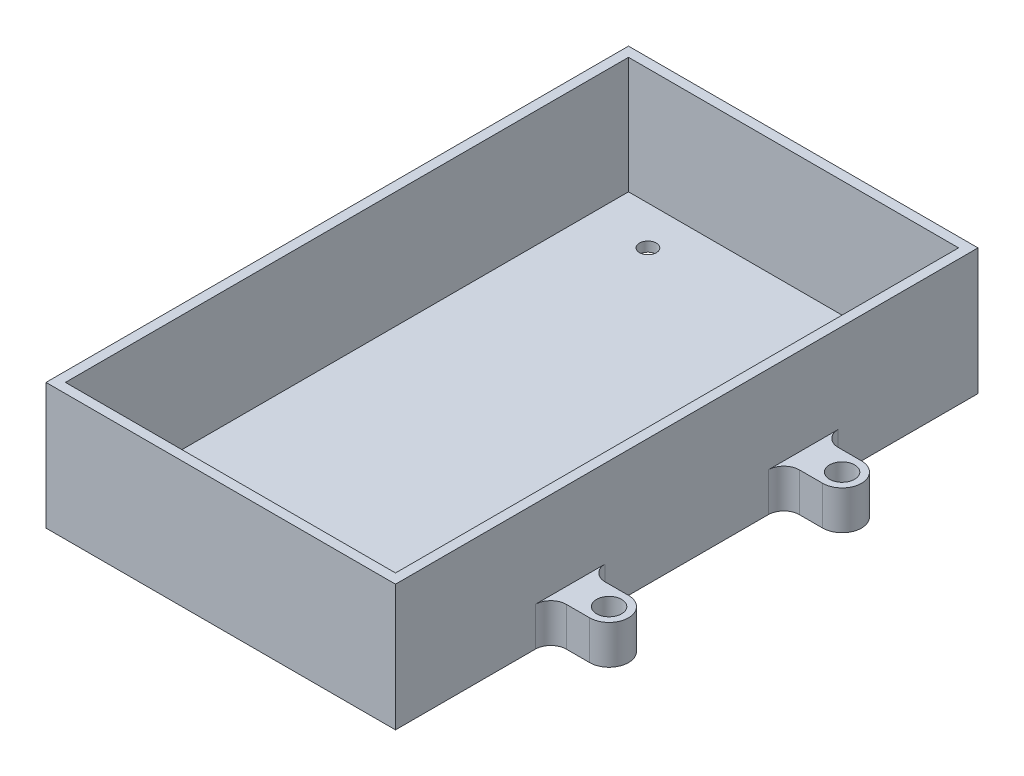
ISO-10303-21;
HEADER;
FILE_DESCRIPTION(('STEP AP214'),'2;1');
FILE_NAME('part.step','',(''),(''),'','','');
FILE_SCHEMA(('AUTOMOTIVE_DESIGN { 1 0 10303 214 1 1 1 1 }'));
ENDSEC;
DATA;
#1=APPLICATION_CONTEXT('core data for automotive mechanical design processes');
#2=APPLICATION_PROTOCOL_DEFINITION('international standard','automotive_design',2000,#1);
#3=PRODUCT_CONTEXT('',#1,'mechanical');
#4=PRODUCT('Part','Part','',(#3));
#5=PRODUCT_RELATED_PRODUCT_CATEGORY('part','',(#4));
#6=PRODUCT_DEFINITION_FORMATION('','',#4);
#7=PRODUCT_DEFINITION_CONTEXT('part definition',#1,'design');
#8=PRODUCT_DEFINITION('design','',#6,#7);
#9=PRODUCT_DEFINITION_SHAPE('','',#8);
#10=(LENGTH_UNIT() NAMED_UNIT(*) SI_UNIT(.MILLI.,.METRE.));
#11=(NAMED_UNIT(*) PLANE_ANGLE_UNIT() SI_UNIT($,.RADIAN.));
#12=(NAMED_UNIT(*) SI_UNIT($,.STERADIAN.) SOLID_ANGLE_UNIT());
#13=UNCERTAINTY_MEASURE_WITH_UNIT(LENGTH_MEASURE(1.E-05),#10,'distance_accuracy_value','');
#14=(GEOMETRIC_REPRESENTATION_CONTEXT(3) GLOBAL_UNCERTAINTY_ASSIGNED_CONTEXT((#13)) GLOBAL_UNIT_ASSIGNED_CONTEXT((#10,
#11,#12)) REPRESENTATION_CONTEXT('',''));
#15=CARTESIAN_POINT('',(0.,0.,0.));
#16=DIRECTION('',(0.,0.,1.));
#17=DIRECTION('',(1.,0.,0.));
#18=AXIS2_PLACEMENT_3D('',#15,#16,#17);
#19=CARTESIAN_POINT('',(28.575,-1.5875,0.));
#20=DIRECTION('',(-1.,0.,0.));
#21=DIRECTION('',(0.,0.,1.));
#22=AXIS2_PLACEMENT_3D('',#19,#20,#21);
#23=PLANE('',#22);
#24=DIRECTION('',(0.,0.,1.));
#25=VECTOR('',#24,1.);
#26=CARTESIAN_POINT('',(28.575,4.7625,0.));
#27=LINE('',#26,#25);
#28=CARTESIAN_POINT('',(28.575,4.7625,-24.765));
#29=VERTEX_POINT('',#28);
#30=CARTESIAN_POINT('',(28.575,4.7625,-13.335));
#31=VERTEX_POINT('',#30);
#32=EDGE_CURVE('E265',#29,#31,#27,.T.);
#33=ORIENTED_EDGE('',*,*,#32,.F.);
#34=DIRECTION('',(0.,-1.,0.));
#35=VECTOR('',#34,1.);
#36=CARTESIAN_POINT('',(28.575,-1.5875,-24.765));
#37=LINE('',#36,#35);
#38=CARTESIAN_POINT('',(28.575,-1.5875,-24.765));
#39=VERTEX_POINT('',#38);
#40=EDGE_CURVE('E383',#29,#39,#37,.T.);
#41=ORIENTED_EDGE('',*,*,#40,.T.);
#42=DIRECTION('',(0.,0.,1.));
#43=VECTOR('',#42,1.);
#44=CARTESIAN_POINT('',(28.575,-1.5875,0.));
#45=LINE('',#44,#43);
#46=CARTESIAN_POINT('',(28.575,-1.5875,-47.625));
#47=VERTEX_POINT('',#46);
#48=EDGE_CURVE('E352',#47,#39,#45,.T.);
#49=ORIENTED_EDGE('',*,*,#48,.F.);
#50=DIRECTION('',(0.,1.,0.));
#51=VECTOR('',#50,1.);
#52=CARTESIAN_POINT('',(28.575,-1.5875,-47.625));
#53=LINE('',#52,#51);
#54=CARTESIAN_POINT('',(28.575,19.05,-47.625));
#55=VERTEX_POINT('',#54);
#56=EDGE_CURVE('E367',#47,#55,#53,.T.);
#57=ORIENTED_EDGE('',*,*,#56,.T.);
#58=DIRECTION('',(0.,0.,1.));
#59=VECTOR('',#58,1.);
#60=CARTESIAN_POINT('',(28.575,19.05,0.));
#61=LINE('',#60,#59);
#62=CARTESIAN_POINT('',(28.575,19.05,47.625));
#63=VERTEX_POINT('',#62);
#64=EDGE_CURVE('E306',#55,#63,#61,.T.);
#65=ORIENTED_EDGE('',*,*,#64,.T.);
#66=DIRECTION('',(0.,1.,0.));
#67=VECTOR('',#66,1.);
#68=CARTESIAN_POINT('',(28.575,-1.5875,47.625));
#69=LINE('',#68,#67);
#70=CARTESIAN_POINT('',(28.575,-1.5875,47.625));
#71=VERTEX_POINT('',#70);
#72=EDGE_CURVE('E370',#71,#63,#69,.T.);
#73=ORIENTED_EDGE('',*,*,#72,.F.);
#74=CARTESIAN_POINT('',(28.575,-1.5875,24.765));
#75=VERTEX_POINT('',#74);
#76=EDGE_CURVE('E351',#75,#71,#45,.T.);
#77=ORIENTED_EDGE('',*,*,#76,.F.);
#78=DIRECTION('',(0.,-1.,0.));
#79=VECTOR('',#78,1.);
#80=CARTESIAN_POINT('',(28.575,-1.5875,24.765));
#81=LINE('',#80,#79);
#82=CARTESIAN_POINT('',(28.575,4.7625,24.765));
#83=VERTEX_POINT('',#82);
#84=EDGE_CURVE('E369',#75,#83,#81,.F.);
#85=ORIENTED_EDGE('',*,*,#84,.T.);
#86=DIRECTION('',(0.,0.,1.));
#87=VECTOR('',#86,1.);
#88=CARTESIAN_POINT('',(28.575,4.7625,0.));
#89=LINE('',#88,#87);
#90=CARTESIAN_POINT('',(28.575,4.7625,13.335));
#91=VERTEX_POINT('',#90);
#92=EDGE_CURVE('E254',#91,#83,#89,.T.);
#93=ORIENTED_EDGE('',*,*,#92,.F.);
#94=DIRECTION('',(0.,-1.,0.));
#95=VECTOR('',#94,1.);
#96=CARTESIAN_POINT('',(28.575,-1.5875,13.335));
#97=LINE('',#96,#95);
#98=CARTESIAN_POINT('',(28.575,-1.5875,13.335));
#99=VERTEX_POINT('',#98);
#100=EDGE_CURVE('E377',#91,#99,#97,.T.);
#101=ORIENTED_EDGE('',*,*,#100,.T.);
#102=CARTESIAN_POINT('',(28.575,-1.5875,-13.335));
#103=VERTEX_POINT('',#102);
#104=EDGE_CURVE('E356',#103,#99,#45,.T.);
#105=ORIENTED_EDGE('',*,*,#104,.F.);
#106=DIRECTION('',(0.,-1.,0.));
#107=VECTOR('',#106,1.);
#108=CARTESIAN_POINT('',(28.575,4.7625,-13.335));
#109=LINE('',#108,#107);
#110=EDGE_CURVE('E380',#103,#31,#109,.F.);
#111=ORIENTED_EDGE('',*,*,#110,.T.);
#112=EDGE_LOOP('',(#33,#41,#49,#57,#65,#73,#77,#85,#93,#101,#105,#111));
#113=FACE_BOUND('',#112,.T.);
#114=ADVANCED_FACE('F77',(#113),#23,.F.);
#115=CARTESIAN_POINT('',(0.,0.,0.));
#116=DIRECTION('',(0.,1.,0.));
#117=DIRECTION('',(0.,0.,1.));
#118=AXIS2_PLACEMENT_3D('',#115,#116,#117);
#119=PLANE('',#118);
#120=CARTESIAN_POINT('',(17.4624999999999,0.,39.6875));
#121=DIRECTION('',(0.,1.,0.));
#122=DIRECTION('',(0.,0.,1.));
#123=AXIS2_PLACEMENT_3D('',#120,#121,#122);
#124=CIRCLE('',#123,1.375);
#125=CARTESIAN_POINT('',(17.4624999999999,0.,41.0625));
#126=VERTEX_POINT('',#125);
#127=EDGE_CURVE('E334',#126,#126,#124,.F.);
#128=ORIENTED_EDGE('',*,*,#127,.T.);
#129=EDGE_LOOP('',(#128));
#130=FACE_BOUND('',#129,.T.);
#131=CARTESIAN_POINT('',(-17.4625,0.,-39.6875));
#132=DIRECTION('',(0.,1.,0.));
#133=DIRECTION('',(0.,0.,1.));
#134=AXIS2_PLACEMENT_3D('',#131,#132,#133);
#135=CIRCLE('',#134,1.375);
#136=CARTESIAN_POINT('',(-17.4625,0.,-38.3125));
#137=VERTEX_POINT('',#136);
#138=EDGE_CURVE('E362',#137,#137,#135,.T.);
#139=ORIENTED_EDGE('',*,*,#138,.F.);
#140=EDGE_LOOP('',(#139));
#141=FACE_BOUND('',#140,.T.);
#142=CARTESIAN_POINT('',(17.4625,0.,-39.6875));
#143=DIRECTION('',(0.,1.,0.));
#144=DIRECTION('',(0.,0.,1.));
#145=AXIS2_PLACEMENT_3D('',#142,#143,#144);
#146=CIRCLE('',#145,1.375);
#147=CARTESIAN_POINT('',(17.4625,0.,-38.3125));
#148=VERTEX_POINT('',#147);
#149=EDGE_CURVE('E359',#148,#148,#146,.T.);
#150=ORIENTED_EDGE('',*,*,#149,.F.);
#151=EDGE_LOOP('',(#150));
#152=FACE_BOUND('',#151,.T.);
#153=CARTESIAN_POINT('',(-17.4625000000001,0.,39.6875));
#154=DIRECTION('',(0.,1.,0.));
#155=DIRECTION('',(0.,0.,1.));
#156=AXIS2_PLACEMENT_3D('',#153,#154,#155);
#157=CIRCLE('',#156,1.375);
#158=CARTESIAN_POINT('',(-17.4625000000001,0.,41.0625));
#159=VERTEX_POINT('',#158);
#160=EDGE_CURVE('E329',#159,#159,#157,.F.);
#161=ORIENTED_EDGE('',*,*,#160,.T.);
#162=EDGE_LOOP('',(#161));
#163=FACE_BOUND('',#162,.T.);
#164=DIRECTION('',(0.,0.,-1.));
#165=VECTOR('',#164,1.);
#166=CARTESIAN_POINT('',(-26.9875,0.,0.));
#167=LINE('',#166,#165);
#168=CARTESIAN_POINT('',(-26.9875,0.,46.0375));
#169=VERTEX_POINT('',#168);
#170=CARTESIAN_POINT('',(-26.9875,0.,-46.0375));
#171=VERTEX_POINT('',#170);
#172=EDGE_CURVE('E312',#169,#171,#167,.T.);
#173=ORIENTED_EDGE('',*,*,#172,.F.);
#174=DIRECTION('',(-1.,0.,0.));
#175=VECTOR('',#174,1.);
#176=CARTESIAN_POINT('',(0.,0.,46.0375));
#177=LINE('',#176,#175);
#178=CARTESIAN_POINT('',(26.9875,0.,46.0375));
#179=VERTEX_POINT('',#178);
#180=EDGE_CURVE('E282',#179,#169,#177,.T.);
#181=ORIENTED_EDGE('',*,*,#180,.F.);
#182=DIRECTION('',(0.,0.,-1.));
#183=VECTOR('',#182,1.);
#184=CARTESIAN_POINT('',(26.9875,0.,0.));
#185=LINE('',#184,#183);
#186=CARTESIAN_POINT('',(26.9875,0.,-46.0375));
#187=VERTEX_POINT('',#186);
#188=EDGE_CURVE('E289',#179,#187,#185,.T.);
#189=ORIENTED_EDGE('',*,*,#188,.T.);
#190=DIRECTION('',(-1.,0.,0.));
#191=VECTOR('',#190,1.);
#192=CARTESIAN_POINT('',(0.,0.,-46.0375));
#193=LINE('',#192,#191);
#194=EDGE_CURVE('E315',#187,#171,#193,.T.);
#195=ORIENTED_EDGE('',*,*,#194,.T.);
#196=EDGE_LOOP('',(#173,#181,#189,#195));
#197=FACE_BOUND('',#196,.T.);
#198=ADVANCED_FACE('F473',(#130,#141,#152,#163,#197),#119,.T.);
#199=CARTESIAN_POINT('',(0.,-1.5875,-47.625));
#200=DIRECTION('',(0.,0.,-1.));
#201=DIRECTION('',(-1.,0.,0.));
#202=AXIS2_PLACEMENT_3D('',#199,#200,#201);
#203=PLANE('',#202);
#204=DIRECTION('',(0.,1.,0.));
#205=VECTOR('',#204,1.);
#206=CARTESIAN_POINT('',(-28.575,-1.5875,-47.625));
#207=LINE('',#206,#205);
#208=CARTESIAN_POINT('',(-28.575,-1.5875,-47.625));
#209=VERTEX_POINT('',#208);
#210=CARTESIAN_POINT('',(-28.575,19.05,-47.625));
#211=VERTEX_POINT('',#210);
#212=EDGE_CURVE('E355',#209,#211,#207,.T.);
#213=ORIENTED_EDGE('',*,*,#212,.T.);
#214=DIRECTION('',(-1.,0.,0.));
#215=VECTOR('',#214,1.);
#216=CARTESIAN_POINT('',(0.,19.05,-47.625));
#217=LINE('',#216,#215);
#218=EDGE_CURVE('E297',#55,#211,#217,.T.);
#219=ORIENTED_EDGE('',*,*,#218,.F.);
#220=ORIENTED_EDGE('',*,*,#56,.F.);
#221=DIRECTION('',(-1.,0.,0.));
#222=VECTOR('',#221,1.);
#223=CARTESIAN_POINT('',(0.,-1.5875,-47.625));
#224=LINE('',#223,#222);
#225=EDGE_CURVE('E343',#47,#209,#224,.T.);
#226=ORIENTED_EDGE('',*,*,#225,.T.);
#227=EDGE_LOOP('',(#213,#219,#220,#226));
#228=FACE_BOUND('',#227,.T.);
#229=ADVANCED_FACE('F443',(#228),#203,.T.);
#230=CARTESIAN_POINT('',(0.,-1.5875,47.625));
#231=DIRECTION('',(0.,0.,-1.));
#232=DIRECTION('',(-1.,0.,0.));
#233=AXIS2_PLACEMENT_3D('',#230,#231,#232);
#234=PLANE('',#233);
#235=ORIENTED_EDGE('',*,*,#72,.T.);
#236=DIRECTION('',(-1.,0.,0.));
#237=VECTOR('',#236,1.);
#238=CARTESIAN_POINT('',(0.,19.05,47.625));
#239=LINE('',#238,#237);
#240=CARTESIAN_POINT('',(-28.575,19.05,47.625));
#241=VERTEX_POINT('',#240);
#242=EDGE_CURVE('E303',#63,#241,#239,.T.);
#243=ORIENTED_EDGE('',*,*,#242,.T.);
#244=DIRECTION('',(0.,1.,0.));
#245=VECTOR('',#244,1.);
#246=CARTESIAN_POINT('',(-28.575,-1.5875,47.625));
#247=LINE('',#246,#245);
#248=CARTESIAN_POINT('',(-28.575,-1.5875,47.625));
#249=VERTEX_POINT('',#248);
#250=EDGE_CURVE('E372',#249,#241,#247,.T.);
#251=ORIENTED_EDGE('',*,*,#250,.F.);
#252=DIRECTION('',(-1.,0.,0.));
#253=VECTOR('',#252,1.);
#254=CARTESIAN_POINT('',(0.,-1.5875,47.625));
#255=LINE('',#254,#253);
#256=EDGE_CURVE('E349',#71,#249,#255,.T.);
#257=ORIENTED_EDGE('',*,*,#256,.F.);
#258=EDGE_LOOP('',(#235,#243,#251,#257));
#259=FACE_BOUND('',#258,.T.);
#260=ADVANCED_FACE('F452',(#259),#234,.F.);
#261=CARTESIAN_POINT('',(17.4624999999999,-1.5875,39.6875));
#262=DIRECTION('',(0.,1.,0.));
#263=DIRECTION('',(0.,0.,1.));
#264=AXIS2_PLACEMENT_3D('',#261,#262,#263);
#265=CYLINDRICAL_SURFACE('',#264,1.375);
#266=CARTESIAN_POINT('',(17.4624999999999,-1.5875,39.6875));
#267=DIRECTION('',(0.,1.,0.));
#268=DIRECTION('',(0.,0.,1.));
#269=AXIS2_PLACEMENT_3D('',#266,#267,#268);
#270=CIRCLE('',#269,1.375);
#271=CARTESIAN_POINT('',(17.4624999999999,-1.5875,41.0625));
#272=VERTEX_POINT('',#271);
#273=EDGE_CURVE('E340',#272,#272,#270,.F.);
#274=ORIENTED_EDGE('',*,*,#273,.T.);
#275=EDGE_LOOP('',(#274));
#276=FACE_BOUND('',#275,.T.);
#277=ORIENTED_EDGE('',*,*,#127,.F.);
#278=EDGE_LOOP('',(#277));
#279=FACE_BOUND('',#278,.T.);
#280=ADVANCED_FACE('F481',(#276,#279),#265,.F.);
#281=CARTESIAN_POINT('',(-17.4625,-1.5875,-39.6875));
#282=DIRECTION('',(0.,1.,0.));
#283=DIRECTION('',(0.,0.,1.));
#284=AXIS2_PLACEMENT_3D('',#281,#282,#283);
#285=CYLINDRICAL_SURFACE('',#284,1.375);
#286=CARTESIAN_POINT('',(-17.4625,-1.5875,-39.6875));
#287=DIRECTION('',(0.,1.,0.));
#288=DIRECTION('',(0.,0.,1.));
#289=AXIS2_PLACEMENT_3D('',#286,#287,#288);
#290=CIRCLE('',#289,1.375);
#291=CARTESIAN_POINT('',(-17.4625,-1.5875,-38.3125));
#292=VERTEX_POINT('',#291);
#293=EDGE_CURVE('E337',#292,#292,#290,.T.);
#294=ORIENTED_EDGE('',*,*,#293,.F.);
#295=EDGE_LOOP('',(#294));
#296=FACE_BOUND('',#295,.T.);
#297=ORIENTED_EDGE('',*,*,#138,.T.);
#298=EDGE_LOOP('',(#297));
#299=FACE_BOUND('',#298,.T.);
#300=ADVANCED_FACE('F486',(#296,#299),#285,.F.);
#301=CARTESIAN_POINT('',(17.4625,-1.5875,-39.6875));
#302=DIRECTION('',(0.,1.,0.));
#303=DIRECTION('',(0.,0.,1.));
#304=AXIS2_PLACEMENT_3D('',#301,#302,#303);
#305=CYLINDRICAL_SURFACE('',#304,1.375);
#306=CARTESIAN_POINT('',(17.4625,-1.5875,-39.6875));
#307=DIRECTION('',(0.,1.,0.));
#308=DIRECTION('',(0.,0.,1.));
#309=AXIS2_PLACEMENT_3D('',#306,#307,#308);
#310=CIRCLE('',#309,1.375);
#311=CARTESIAN_POINT('',(17.4625,-1.5875,-38.3125));
#312=VERTEX_POINT('',#311);
#313=EDGE_CURVE('E333',#312,#312,#310,.T.);
#314=ORIENTED_EDGE('',*,*,#313,.F.);
#315=EDGE_LOOP('',(#314));
#316=FACE_BOUND('',#315,.T.);
#317=ORIENTED_EDGE('',*,*,#149,.T.);
#318=EDGE_LOOP('',(#317));
#319=FACE_BOUND('',#318,.T.);
#320=ADVANCED_FACE('F467',(#316,#319),#305,.F.);
#321=CARTESIAN_POINT('',(-17.4625000000001,-1.5875,39.6875));
#322=DIRECTION('',(0.,1.,0.));
#323=DIRECTION('',(0.,0.,1.));
#324=AXIS2_PLACEMENT_3D('',#321,#322,#323);
#325=CYLINDRICAL_SURFACE('',#324,1.375);
#326=CARTESIAN_POINT('',(-17.4625000000001,-1.5875,39.6875));
#327=DIRECTION('',(0.,1.,0.));
#328=DIRECTION('',(0.,0.,1.));
#329=AXIS2_PLACEMENT_3D('',#326,#327,#328);
#330=CIRCLE('',#329,1.375);
#331=CARTESIAN_POINT('',(-17.4625000000001,-1.5875,41.0625));
#332=VERTEX_POINT('',#331);
#333=EDGE_CURVE('E330',#332,#332,#330,.F.);
#334=ORIENTED_EDGE('',*,*,#333,.T.);
#335=EDGE_LOOP('',(#334));
#336=FACE_BOUND('',#335,.T.);
#337=ORIENTED_EDGE('',*,*,#160,.F.);
#338=EDGE_LOOP('',(#337));
#339=FACE_BOUND('',#338,.T.);
#340=ADVANCED_FACE('F456',(#336,#339),#325,.F.);
#341=CARTESIAN_POINT('',(-28.575,-1.5875,0.));
#342=DIRECTION('',(-1.,0.,0.));
#343=DIRECTION('',(0.,0.,1.));
#344=AXIS2_PLACEMENT_3D('',#341,#342,#343);
#345=PLANE('',#344);
#346=ORIENTED_EDGE('',*,*,#250,.T.);
#347=DIRECTION('',(0.,0.,1.));
#348=VECTOR('',#347,1.);
#349=CARTESIAN_POINT('',(-28.575,19.05,0.));
#350=LINE('',#349,#348);
#351=EDGE_CURVE('E300',#211,#241,#350,.T.);
#352=ORIENTED_EDGE('',*,*,#351,.F.);
#353=ORIENTED_EDGE('',*,*,#212,.F.);
#354=DIRECTION('',(0.,0.,1.));
#355=VECTOR('',#354,1.);
#356=CARTESIAN_POINT('',(-28.575,-1.5875,0.));
#357=LINE('',#356,#355);
#358=EDGE_CURVE('E346',#209,#249,#357,.T.);
#359=ORIENTED_EDGE('',*,*,#358,.T.);
#360=EDGE_LOOP('',(#346,#352,#353,#359));
#361=FACE_BOUND('',#360,.T.);
#362=ADVANCED_FACE('F454',(#361),#345,.T.);
#363=CARTESIAN_POINT('',(0.,-1.5875,0.));
#364=DIRECTION('',(0.,1.,0.));
#365=DIRECTION('',(0.,0.,1.));
#366=AXIS2_PLACEMENT_3D('',#363,#364,#365);
#367=PLANE('',#366);
#368=ORIENTED_EDGE('',*,*,#333,.F.);
#369=EDGE_LOOP('',(#368));
#370=FACE_BOUND('',#369,.T.);
#371=ORIENTED_EDGE('',*,*,#313,.T.);
#372=EDGE_LOOP('',(#371));
#373=FACE_BOUND('',#372,.T.);
#374=ORIENTED_EDGE('',*,*,#293,.T.);
#375=EDGE_LOOP('',(#374));
#376=FACE_BOUND('',#375,.T.);
#377=ORIENTED_EDGE('',*,*,#273,.F.);
#378=EDGE_LOOP('',(#377));
#379=FACE_BOUND('',#378,.T.);
#380=ORIENTED_EDGE('',*,*,#225,.F.);
#381=ORIENTED_EDGE('',*,*,#48,.T.);
#382=CARTESIAN_POINT('',(31.115,-1.5875,-24.765));
#383=DIRECTION('',(0.,1.,0.));
#384=DIRECTION('',(0.,0.,1.));
#385=AXIS2_PLACEMENT_3D('',#382,#383,#384);
#386=CIRCLE('',#385,2.54);
#387=CARTESIAN_POINT('',(31.115,-1.5875,-22.225));
#388=VERTEX_POINT('',#387);
#389=EDGE_CURVE('E395',#39,#388,#386,.T.);
#390=ORIENTED_EDGE('',*,*,#389,.T.);
#391=DIRECTION('',(-1.,0.,0.));
#392=VECTOR('',#391,1.);
#393=CARTESIAN_POINT('',(0.,-1.5875,-22.2249999999999));
#394=LINE('',#393,#392);
#395=CARTESIAN_POINT('',(34.925,-1.5875,-22.225));
#396=VERTEX_POINT('',#395);
#397=EDGE_CURVE('E249',#396,#388,#394,.T.);
#398=ORIENTED_EDGE('',*,*,#397,.F.);
#399=CARTESIAN_POINT('',(34.925,-1.5875,-19.05));
#400=DIRECTION('',(0.,-1.,0.));
#401=DIRECTION('',(0.,0.,-1.));
#402=AXIS2_PLACEMENT_3D('',#399,#400,#401);
#403=CIRCLE('',#402,3.175);
#404=CARTESIAN_POINT('',(34.925,-1.5875,-15.875));
#405=VERTEX_POINT('',#404);
#406=EDGE_CURVE('E273',#405,#396,#403,.F.);
#407=ORIENTED_EDGE('',*,*,#406,.F.);
#408=DIRECTION('',(1.,0.,0.));
#409=VECTOR('',#408,1.);
#410=CARTESIAN_POINT('',(0.,-1.5875,-15.875));
#411=LINE('',#410,#409);
#412=CARTESIAN_POINT('',(31.115,-1.5875,-15.875));
#413=VERTEX_POINT('',#412);
#414=EDGE_CURVE('E275',#413,#405,#411,.T.);
#415=ORIENTED_EDGE('',*,*,#414,.F.);
#416=CARTESIAN_POINT('',(31.115,-1.5875,-13.335));
#417=DIRECTION('',(0.,1.,0.));
#418=DIRECTION('',(0.,0.,1.));
#419=AXIS2_PLACEMENT_3D('',#416,#417,#418);
#420=CIRCLE('',#419,2.54);
#421=EDGE_CURVE('E400',#413,#103,#420,.T.);
#422=ORIENTED_EDGE('',*,*,#421,.T.);
#423=ORIENTED_EDGE('',*,*,#104,.T.);
#424=CARTESIAN_POINT('',(31.115,-1.5875,13.335));
#425=DIRECTION('',(0.,1.,0.));
#426=DIRECTION('',(0.,0.,1.));
#427=AXIS2_PLACEMENT_3D('',#424,#425,#426);
#428=CIRCLE('',#427,2.54);
#429=CARTESIAN_POINT('',(31.115,-1.5875,15.875));
#430=VERTEX_POINT('',#429);
#431=EDGE_CURVE('E223',#99,#430,#428,.T.);
#432=ORIENTED_EDGE('',*,*,#431,.T.);
#433=DIRECTION('',(1.,0.,0.));
#434=VECTOR('',#433,1.);
#435=CARTESIAN_POINT('',(0.,-1.5875,15.875));
#436=LINE('',#435,#434);
#437=CARTESIAN_POINT('',(34.925,-1.5875,15.875));
#438=VERTEX_POINT('',#437);
#439=EDGE_CURVE('E213',#430,#438,#436,.T.);
#440=ORIENTED_EDGE('',*,*,#439,.T.);
#441=CARTESIAN_POINT('',(34.925,-1.5875,19.05));
#442=DIRECTION('',(0.,-1.,0.));
#443=DIRECTION('',(0.,0.,-1.));
#444=AXIS2_PLACEMENT_3D('',#441,#442,#443);
#445=CIRCLE('',#444,3.175);
#446=CARTESIAN_POINT('',(34.925,-1.5875,22.225));
#447=VERTEX_POINT('',#446);
#448=EDGE_CURVE('E220',#438,#447,#445,.T.);
#449=ORIENTED_EDGE('',*,*,#448,.T.);
#450=DIRECTION('',(-1.,0.,0.));
#451=VECTOR('',#450,1.);
#452=CARTESIAN_POINT('',(0.,-1.5875,22.225));
#453=LINE('',#452,#451);
#454=CARTESIAN_POINT('',(31.115,-1.5875,22.225));
#455=VERTEX_POINT('',#454);
#456=EDGE_CURVE('E226',#447,#455,#453,.T.);
#457=ORIENTED_EDGE('',*,*,#456,.T.);
#458=CARTESIAN_POINT('',(31.115,-1.5875,24.765));
#459=DIRECTION('',(0.,1.,0.));
#460=DIRECTION('',(0.,0.,1.));
#461=AXIS2_PLACEMENT_3D('',#458,#459,#460);
#462=CIRCLE('',#461,2.54);
#463=EDGE_CURVE('E85',#455,#75,#462,.T.);
#464=ORIENTED_EDGE('',*,*,#463,.T.);
#465=ORIENTED_EDGE('',*,*,#76,.T.);
#466=ORIENTED_EDGE('',*,*,#256,.T.);
#467=ORIENTED_EDGE('',*,*,#358,.F.);
#468=EDGE_LOOP('',(#380,#381,#390,#398,#407,#415,#422,#423,#432,#440,#449,#457,#464,#465,#466,#467));
#469=FACE_BOUND('',#468,.T.);
#470=CARTESIAN_POINT('',(34.925,-1.5875,-19.05));
#471=DIRECTION('',(0.,-1.,0.));
#472=DIRECTION('',(0.,0.,-1.));
#473=AXIS2_PLACEMENT_3D('',#470,#471,#472);
#474=CIRCLE('',#473,2.05);
#475=CARTESIAN_POINT('',(34.925,-1.5875,-21.1));
#476=VERTEX_POINT('',#475);
#477=EDGE_CURVE('E261',#476,#476,#474,.F.);
#478=ORIENTED_EDGE('',*,*,#477,.T.);
#479=EDGE_LOOP('',(#478));
#480=FACE_BOUND('',#479,.T.);
#481=CARTESIAN_POINT('',(34.925,-1.5875,19.05));
#482=DIRECTION('',(0.,-1.,0.));
#483=DIRECTION('',(0.,0.,-1.));
#484=AXIS2_PLACEMENT_3D('',#481,#482,#483);
#485=CIRCLE('',#484,2.05);
#486=CARTESIAN_POINT('',(34.925,-1.5875,17.));
#487=VERTEX_POINT('',#486);
#488=EDGE_CURVE('E244',#487,#487,#485,.T.);
#489=ORIENTED_EDGE('',*,*,#488,.F.);
#490=EDGE_LOOP('',(#489));
#491=FACE_BOUND('',#490,.T.);
#492=ADVANCED_FACE('F216',(#370,#373,#376,#379,#469,#480,#491),#367,.F.);
#493=CARTESIAN_POINT('',(0.,19.05,46.0375));
#494=DIRECTION('',(0.,0.,1.));
#495=DIRECTION('',(1.,0.,0.));
#496=AXIS2_PLACEMENT_3D('',#493,#494,#495);
#497=PLANE('',#496);
#498=ORIENTED_EDGE('',*,*,#180,.T.);
#499=DIRECTION('',(0.,-1.,0.));
#500=VECTOR('',#499,1.);
#501=CARTESIAN_POINT('',(-26.9875,19.05,46.0375));
#502=LINE('',#501,#500);
#503=CARTESIAN_POINT('',(-26.9875,19.05,46.0375));
#504=VERTEX_POINT('',#503);
#505=EDGE_CURVE('E326',#504,#169,#502,.T.);
#506=ORIENTED_EDGE('',*,*,#505,.F.);
#507=DIRECTION('',(-1.,0.,0.));
#508=VECTOR('',#507,1.);
#509=CARTESIAN_POINT('',(0.,19.05,46.0375));
#510=LINE('',#509,#508);
#511=CARTESIAN_POINT('',(26.9875,19.05,46.0375));
#512=VERTEX_POINT('',#511);
#513=EDGE_CURVE('E285',#512,#504,#510,.T.);
#514=ORIENTED_EDGE('',*,*,#513,.F.);
#515=DIRECTION('',(0.,-1.,0.));
#516=VECTOR('',#515,1.);
#517=CARTESIAN_POINT('',(26.9875,19.05,46.0375));
#518=LINE('',#517,#516);
#519=EDGE_CURVE('E309',#512,#179,#518,.T.);
#520=ORIENTED_EDGE('',*,*,#519,.T.);
#521=EDGE_LOOP('',(#498,#506,#514,#520));
#522=FACE_BOUND('',#521,.T.);
#523=ADVANCED_FACE('F463',(#522),#497,.F.);
#524=CARTESIAN_POINT('',(-26.9875,19.05,0.));
#525=DIRECTION('',(-1.,0.,0.));
#526=DIRECTION('',(0.,0.,1.));
#527=AXIS2_PLACEMENT_3D('',#524,#525,#526);
#528=PLANE('',#527);
#529=ORIENTED_EDGE('',*,*,#172,.T.);
#530=DIRECTION('',(0.,-1.,0.));
#531=VECTOR('',#530,1.);
#532=CARTESIAN_POINT('',(-26.9875,19.05,-46.0375));
#533=LINE('',#532,#531);
#534=CARTESIAN_POINT('',(-26.9875,19.05,-46.0375));
#535=VERTEX_POINT('',#534);
#536=EDGE_CURVE('E323',#535,#171,#533,.T.);
#537=ORIENTED_EDGE('',*,*,#536,.F.);
#538=DIRECTION('',(0.,0.,-1.));
#539=VECTOR('',#538,1.);
#540=CARTESIAN_POINT('',(-26.9875,19.05,0.));
#541=LINE('',#540,#539);
#542=EDGE_CURVE('E288',#504,#535,#541,.T.);
#543=ORIENTED_EDGE('',*,*,#542,.F.);
#544=ORIENTED_EDGE('',*,*,#505,.T.);
#545=EDGE_LOOP('',(#529,#537,#543,#544));
#546=FACE_BOUND('',#545,.T.);
#547=ADVANCED_FACE('F681',(#546),#528,.F.);
#548=CARTESIAN_POINT('',(0.,19.05,-46.0375));
#549=DIRECTION('',(0.,0.,1.));
#550=DIRECTION('',(1.,0.,0.));
#551=AXIS2_PLACEMENT_3D('',#548,#549,#550);
#552=PLANE('',#551);
#553=ORIENTED_EDGE('',*,*,#194,.F.);
#554=DIRECTION('',(0.,-1.,0.));
#555=VECTOR('',#554,1.);
#556=CARTESIAN_POINT('',(26.9875,19.05,-46.0375));
#557=LINE('',#556,#555);
#558=CARTESIAN_POINT('',(26.9875,19.05,-46.0375));
#559=VERTEX_POINT('',#558);
#560=EDGE_CURVE('E320',#559,#187,#557,.T.);
#561=ORIENTED_EDGE('',*,*,#560,.F.);
#562=DIRECTION('',(-1.,0.,0.));
#563=VECTOR('',#562,1.);
#564=CARTESIAN_POINT('',(0.,19.05,-46.0375));
#565=LINE('',#564,#563);
#566=EDGE_CURVE('E291',#559,#535,#565,.T.);
#567=ORIENTED_EDGE('',*,*,#566,.T.);
#568=ORIENTED_EDGE('',*,*,#536,.T.);
#569=EDGE_LOOP('',(#553,#561,#567,#568));
#570=FACE_BOUND('',#569,.T.);
#571=ADVANCED_FACE('F673',(#570),#552,.T.);
#572=CARTESIAN_POINT('',(26.9875,19.05,0.));
#573=DIRECTION('',(-1.,0.,0.));
#574=DIRECTION('',(0.,0.,1.));
#575=AXIS2_PLACEMENT_3D('',#572,#573,#574);
#576=PLANE('',#575);
#577=ORIENTED_EDGE('',*,*,#188,.F.);
#578=ORIENTED_EDGE('',*,*,#519,.F.);
#579=DIRECTION('',(0.,0.,-1.));
#580=VECTOR('',#579,1.);
#581=CARTESIAN_POINT('',(26.9875,19.05,0.));
#582=LINE('',#581,#580);
#583=EDGE_CURVE('E294',#512,#559,#582,.T.);
#584=ORIENTED_EDGE('',*,*,#583,.T.);
#585=ORIENTED_EDGE('',*,*,#560,.T.);
#586=EDGE_LOOP('',(#577,#578,#584,#585));
#587=FACE_BOUND('',#586,.T.);
#588=ADVANCED_FACE('F665',(#587),#576,.T.);
#589=CARTESIAN_POINT('',(0.,19.05,0.));
#590=DIRECTION('',(0.,1.,0.));
#591=DIRECTION('',(0.,0.,1.));
#592=AXIS2_PLACEMENT_3D('',#589,#590,#591);
#593=PLANE('',#592);
#594=ORIENTED_EDGE('',*,*,#513,.T.);
#595=ORIENTED_EDGE('',*,*,#542,.T.);
#596=ORIENTED_EDGE('',*,*,#566,.F.);
#597=ORIENTED_EDGE('',*,*,#583,.F.);
#598=EDGE_LOOP('',(#594,#595,#596,#597));
#599=FACE_BOUND('',#598,.T.);
#600=ORIENTED_EDGE('',*,*,#218,.T.);
#601=ORIENTED_EDGE('',*,*,#351,.T.);
#602=ORIENTED_EDGE('',*,*,#242,.F.);
#603=ORIENTED_EDGE('',*,*,#64,.F.);
#604=EDGE_LOOP('',(#600,#601,#602,#603));
#605=FACE_BOUND('',#604,.T.);
#606=ADVANCED_FACE('F449',(#599,#605),#593,.T.);
#607=CARTESIAN_POINT('',(0.,4.7625,-22.2249999999999));
#608=DIRECTION('',(0.,0.,1.));
#609=DIRECTION('',(1.,0.,0.));
#610=AXIS2_PLACEMENT_3D('',#607,#608,#609);
#611=PLANE('',#610);
#612=ORIENTED_EDGE('',*,*,#397,.T.);
#613=DIRECTION('',(0.,-1.,0.));
#614=VECTOR('',#613,1.);
#615=CARTESIAN_POINT('',(31.115,4.7625,-22.225));
#616=LINE('',#615,#614);
#617=CARTESIAN_POINT('',(31.115,4.7625,-22.225));
#618=VERTEX_POINT('',#617);
#619=EDGE_CURVE('E386',#388,#618,#616,.F.);
#620=ORIENTED_EDGE('',*,*,#619,.T.);
#621=DIRECTION('',(-1.,0.,0.));
#622=VECTOR('',#621,1.);
#623=CARTESIAN_POINT('',(0.,4.7625,-22.2249999999999));
#624=LINE('',#623,#622);
#625=CARTESIAN_POINT('',(34.925,4.7625,-22.225));
#626=VERTEX_POINT('',#625);
#627=EDGE_CURVE('E257',#626,#618,#624,.T.);
#628=ORIENTED_EDGE('',*,*,#627,.F.);
#629=DIRECTION('',(0.,-1.,0.));
#630=VECTOR('',#629,1.);
#631=CARTESIAN_POINT('',(34.925,4.7625,-22.225));
#632=LINE('',#631,#630);
#633=EDGE_CURVE('E270',#626,#396,#632,.T.);
#634=ORIENTED_EDGE('',*,*,#633,.T.);
#635=EDGE_LOOP('',(#612,#620,#628,#634));
#636=FACE_BOUND('',#635,.T.);
#637=ADVANCED_FACE('F584',(#636),#611,.F.);
#638=CARTESIAN_POINT('',(0.,4.7625,-15.875));
#639=DIRECTION('',(0.,0.,-1.));
#640=DIRECTION('',(-1.,0.,0.));
#641=AXIS2_PLACEMENT_3D('',#638,#639,#640);
#642=PLANE('',#641);
#643=DIRECTION('',(1.,0.,0.));
#644=VECTOR('',#643,1.);
#645=CARTESIAN_POINT('',(0.,4.7625,-15.875));
#646=LINE('',#645,#644);
#647=CARTESIAN_POINT('',(31.115,4.7625,-15.875));
#648=VERTEX_POINT('',#647);
#649=CARTESIAN_POINT('',(34.925,4.7625,-15.875));
#650=VERTEX_POINT('',#649);
#651=EDGE_CURVE('E263',#648,#650,#646,.T.);
#652=ORIENTED_EDGE('',*,*,#651,.F.);
#653=DIRECTION('',(0.,-1.,0.));
#654=VECTOR('',#653,1.);
#655=CARTESIAN_POINT('',(31.115,-1.5875,-15.875));
#656=LINE('',#655,#654);
#657=EDGE_CURVE('E388',#648,#413,#656,.T.);
#658=ORIENTED_EDGE('',*,*,#657,.T.);
#659=ORIENTED_EDGE('',*,*,#414,.T.);
#660=DIRECTION('',(0.,-1.,0.));
#661=VECTOR('',#660,1.);
#662=CARTESIAN_POINT('',(34.925,4.7625,-15.875));
#663=LINE('',#662,#661);
#664=EDGE_CURVE('E279',#650,#405,#663,.T.);
#665=ORIENTED_EDGE('',*,*,#664,.F.);
#666=EDGE_LOOP('',(#652,#658,#659,#665));
#667=FACE_BOUND('',#666,.T.);
#668=ADVANCED_FACE('F429',(#667),#642,.F.);
#669=CARTESIAN_POINT('',(34.925,4.7625,-19.05));
#670=DIRECTION('',(0.,-1.,0.));
#671=DIRECTION('',(0.,0.,-1.));
#672=AXIS2_PLACEMENT_3D('',#669,#670,#671);
#673=CYLINDRICAL_SURFACE('',#672,3.175);
#674=ORIENTED_EDGE('',*,*,#406,.T.);
#675=ORIENTED_EDGE('',*,*,#633,.F.);
#676=CARTESIAN_POINT('',(34.925,4.7625,-19.05));
#677=DIRECTION('',(0.,-1.,0.));
#678=DIRECTION('',(0.,0.,-1.));
#679=AXIS2_PLACEMENT_3D('',#676,#677,#678);
#680=CIRCLE('',#679,3.175);
#681=EDGE_CURVE('E260',#650,#626,#680,.F.);
#682=ORIENTED_EDGE('',*,*,#681,.F.);
#683=ORIENTED_EDGE('',*,*,#664,.T.);
#684=EDGE_LOOP('',(#674,#675,#682,#683));
#685=FACE_BOUND('',#684,.T.);
#686=ADVANCED_FACE('F583',(#685),#673,.T.);
#687=CARTESIAN_POINT('',(34.925,4.7625,-19.05));
#688=DIRECTION('',(0.,-1.,0.));
#689=DIRECTION('',(0.,0.,-1.));
#690=AXIS2_PLACEMENT_3D('',#687,#688,#689);
#691=CYLINDRICAL_SURFACE('',#690,2.05);
#692=CARTESIAN_POINT('',(34.925,4.7625,-19.05));
#693=DIRECTION('',(0.,-1.,0.));
#694=DIRECTION('',(0.,0.,-1.));
#695=AXIS2_PLACEMENT_3D('',#692,#693,#694);
#696=CIRCLE('',#695,2.05);
#697=CARTESIAN_POINT('',(34.925,4.7625,-21.1));
#698=VERTEX_POINT('',#697);
#699=EDGE_CURVE('E267',#698,#698,#696,.F.);
#700=ORIENTED_EDGE('',*,*,#699,.T.);
#701=EDGE_LOOP('',(#700));
#702=FACE_BOUND('',#701,.T.);
#703=ORIENTED_EDGE('',*,*,#477,.F.);
#704=EDGE_LOOP('',(#703));
#705=FACE_BOUND('',#704,.T.);
#706=ADVANCED_FACE('F575',(#702,#705),#691,.F.);
#707=CARTESIAN_POINT('',(0.,4.7625,0.));
#708=DIRECTION('',(0.,-1.,0.));
#709=DIRECTION('',(0.,0.,-1.));
#710=AXIS2_PLACEMENT_3D('',#707,#708,#709);
#711=PLANE('',#710);
#712=ORIENTED_EDGE('',*,*,#627,.T.);
#713=CARTESIAN_POINT('',(31.115,4.7625,-24.765));
#714=DIRECTION('',(0.,-1.,0.));
#715=DIRECTION('',(0.,0.,-1.));
#716=AXIS2_PLACEMENT_3D('',#713,#714,#715);
#717=CIRCLE('',#716,2.54);
#718=EDGE_CURVE('E397',#618,#29,#717,.T.);
#719=ORIENTED_EDGE('',*,*,#718,.T.);
#720=ORIENTED_EDGE('',*,*,#32,.T.);
#721=CARTESIAN_POINT('',(31.115,4.7625,-13.335));
#722=DIRECTION('',(0.,-1.,0.));
#723=DIRECTION('',(0.,0.,-1.));
#724=AXIS2_PLACEMENT_3D('',#721,#722,#723);
#725=CIRCLE('',#724,2.54);
#726=EDGE_CURVE('E402',#31,#648,#725,.T.);
#727=ORIENTED_EDGE('',*,*,#726,.T.);
#728=ORIENTED_EDGE('',*,*,#651,.T.);
#729=ORIENTED_EDGE('',*,*,#681,.T.);
#730=EDGE_LOOP('',(#712,#719,#720,#727,#728,#729));
#731=FACE_BOUND('',#730,.T.);
#732=ORIENTED_EDGE('',*,*,#699,.F.);
#733=EDGE_LOOP('',(#732));
#734=FACE_BOUND('',#733,.T.);
#735=ADVANCED_FACE('F433',(#731,#734),#711,.F.);
#736=CARTESIAN_POINT('',(0.,4.7625,15.875));
#737=DIRECTION('',(0.,0.,-1.));
#738=DIRECTION('',(-1.,0.,0.));
#739=AXIS2_PLACEMENT_3D('',#736,#737,#738);
#740=PLANE('',#739);
#741=ORIENTED_EDGE('',*,*,#439,.F.);
#742=DIRECTION('',(0.,-1.,0.));
#743=VECTOR('',#742,1.);
#744=CARTESIAN_POINT('',(31.115,4.7625,15.875));
#745=LINE('',#744,#743);
#746=CARTESIAN_POINT('',(31.115,4.7625,15.875));
#747=VERTEX_POINT('',#746);
#748=EDGE_CURVE('E391',#430,#747,#745,.F.);
#749=ORIENTED_EDGE('',*,*,#748,.T.);
#750=DIRECTION('',(1.,0.,0.));
#751=VECTOR('',#750,1.);
#752=CARTESIAN_POINT('',(0.,4.7625,15.875));
#753=LINE('',#752,#751);
#754=CARTESIAN_POINT('',(34.925,4.7625,15.875));
#755=VERTEX_POINT('',#754);
#756=EDGE_CURVE('E233',#747,#755,#753,.T.);
#757=ORIENTED_EDGE('',*,*,#756,.T.);
#758=DIRECTION('',(0.,-1.,0.));
#759=VECTOR('',#758,1.);
#760=CARTESIAN_POINT('',(34.925,4.7625,15.875));
#761=LINE('',#760,#759);
#762=EDGE_CURVE('E230',#755,#438,#761,.T.);
#763=ORIENTED_EDGE('',*,*,#762,.T.);
#764=EDGE_LOOP('',(#741,#749,#757,#763));
#765=FACE_BOUND('',#764,.T.);
#766=ADVANCED_FACE('F231',(#765),#740,.T.);
#767=CARTESIAN_POINT('',(0.,4.7625,22.225));
#768=DIRECTION('',(0.,0.,1.));
#769=DIRECTION('',(1.,0.,0.));
#770=AXIS2_PLACEMENT_3D('',#767,#768,#769);
#771=PLANE('',#770);
#772=DIRECTION('',(-1.,0.,0.));
#773=VECTOR('',#772,1.);
#774=CARTESIAN_POINT('',(0.,4.7625,22.225));
#775=LINE('',#774,#773);
#776=CARTESIAN_POINT('',(34.925,4.7625,22.225));
#777=VERTEX_POINT('',#776);
#778=CARTESIAN_POINT('',(31.115,4.7625,22.225));
#779=VERTEX_POINT('',#778);
#780=EDGE_CURVE('E227',#777,#779,#775,.T.);
#781=ORIENTED_EDGE('',*,*,#780,.T.);
#782=DIRECTION('',(0.,-1.,0.));
#783=VECTOR('',#782,1.);
#784=CARTESIAN_POINT('',(31.115,4.7625,22.225));
#785=LINE('',#784,#783);
#786=EDGE_CURVE('E393',#779,#455,#785,.T.);
#787=ORIENTED_EDGE('',*,*,#786,.T.);
#788=ORIENTED_EDGE('',*,*,#456,.F.);
#789=DIRECTION('',(0.,-1.,0.));
#790=VECTOR('',#789,1.);
#791=CARTESIAN_POINT('',(34.925,4.7625,22.225));
#792=LINE('',#791,#790);
#793=EDGE_CURVE('E237',#777,#447,#792,.T.);
#794=ORIENTED_EDGE('',*,*,#793,.F.);
#795=EDGE_LOOP('',(#781,#787,#788,#794));
#796=FACE_BOUND('',#795,.T.);
#797=ADVANCED_FACE('F412',(#796),#771,.T.);
#798=CARTESIAN_POINT('',(0.,4.7625,0.));
#799=DIRECTION('',(0.,-1.,0.));
#800=DIRECTION('',(0.,0.,-1.));
#801=AXIS2_PLACEMENT_3D('',#798,#799,#800);
#802=PLANE('',#801);
#803=ORIENTED_EDGE('',*,*,#780,.F.);
#804=CARTESIAN_POINT('',(34.925,4.7625,19.05));
#805=DIRECTION('',(0.,-1.,0.));
#806=DIRECTION('',(0.,0.,-1.));
#807=AXIS2_PLACEMENT_3D('',#804,#805,#806);
#808=CIRCLE('',#807,3.175);
#809=EDGE_CURVE('E241',#755,#777,#808,.T.);
#810=ORIENTED_EDGE('',*,*,#809,.F.);
#811=ORIENTED_EDGE('',*,*,#756,.F.);
#812=CARTESIAN_POINT('',(31.115,4.7625,13.335));
#813=DIRECTION('',(0.,-1.,0.));
#814=DIRECTION('',(0.,0.,-1.));
#815=AXIS2_PLACEMENT_3D('',#812,#813,#814);
#816=CIRCLE('',#815,2.54);
#817=EDGE_CURVE('E405',#747,#91,#816,.T.);
#818=ORIENTED_EDGE('',*,*,#817,.T.);
#819=ORIENTED_EDGE('',*,*,#92,.T.);
#820=CARTESIAN_POINT('',(31.115,4.7625,24.765));
#821=DIRECTION('',(0.,-1.,0.));
#822=DIRECTION('',(0.,0.,-1.));
#823=AXIS2_PLACEMENT_3D('',#820,#821,#822);
#824=CIRCLE('',#823,2.54);
#825=EDGE_CURVE('E12',#83,#779,#824,.T.);
#826=ORIENTED_EDGE('',*,*,#825,.T.);
#827=EDGE_LOOP('',(#803,#810,#811,#818,#819,#826));
#828=FACE_BOUND('',#827,.T.);
#829=CARTESIAN_POINT('',(34.925,4.7625,19.05));
#830=DIRECTION('',(0.,-1.,0.));
#831=DIRECTION('',(0.,0.,-1.));
#832=AXIS2_PLACEMENT_3D('',#829,#830,#831);
#833=CIRCLE('',#832,2.05);
#834=CARTESIAN_POINT('',(34.925,4.7625,17.));
#835=VERTEX_POINT('',#834);
#836=EDGE_CURVE('E240',#835,#835,#833,.T.);
#837=ORIENTED_EDGE('',*,*,#836,.T.);
#838=EDGE_LOOP('',(#837));
#839=FACE_BOUND('',#838,.T.);
#840=ADVANCED_FACE('F413',(#828,#839),#802,.F.);
#841=CARTESIAN_POINT('',(34.925,4.7625,19.05));
#842=DIRECTION('',(0.,-1.,0.));
#843=DIRECTION('',(0.,0.,-1.));
#844=AXIS2_PLACEMENT_3D('',#841,#842,#843);
#845=CYLINDRICAL_SURFACE('',#844,3.175);
#846=ORIENTED_EDGE('',*,*,#762,.F.);
#847=ORIENTED_EDGE('',*,*,#809,.T.);
#848=ORIENTED_EDGE('',*,*,#793,.T.);
#849=ORIENTED_EDGE('',*,*,#448,.F.);
#850=EDGE_LOOP('',(#846,#847,#848,#849));
#851=FACE_BOUND('',#850,.T.);
#852=ADVANCED_FACE('F239',(#851),#845,.T.);
#853=CARTESIAN_POINT('',(34.925,4.7625,19.05));
#854=DIRECTION('',(0.,-1.,0.));
#855=DIRECTION('',(0.,0.,-1.));
#856=AXIS2_PLACEMENT_3D('',#853,#854,#855);
#857=CYLINDRICAL_SURFACE('',#856,2.05);
#858=ORIENTED_EDGE('',*,*,#836,.F.);
#859=EDGE_LOOP('',(#858));
#860=FACE_BOUND('',#859,.T.);
#861=ORIENTED_EDGE('',*,*,#488,.T.);
#862=EDGE_LOOP('',(#861));
#863=FACE_BOUND('',#862,.T.);
#864=ADVANCED_FACE('F501',(#860,#863),#857,.F.);
#865=CARTESIAN_POINT('',(31.115,-1.5875,-24.765));
#866=DIRECTION('',(0.,1.,0.));
#867=DIRECTION('',(0.,0.,1.));
#868=AXIS2_PLACEMENT_3D('',#865,#866,#867);
#869=CYLINDRICAL_SURFACE('',#868,2.54);
#870=ORIENTED_EDGE('',*,*,#718,.F.);
#871=ORIENTED_EDGE('',*,*,#619,.F.);
#872=ORIENTED_EDGE('',*,*,#389,.F.);
#873=ORIENTED_EDGE('',*,*,#40,.F.);
#874=EDGE_LOOP('',(#870,#871,#872,#873));
#875=FACE_BOUND('',#874,.T.);
#876=ADVANCED_FACE('F498',(#875),#869,.F.);
#877=CARTESIAN_POINT('',(31.115,4.7625,-13.335));
#878=DIRECTION('',(0.,1.,0.));
#879=DIRECTION('',(0.,0.,1.));
#880=AXIS2_PLACEMENT_3D('',#877,#878,#879);
#881=CYLINDRICAL_SURFACE('',#880,2.54);
#882=ORIENTED_EDGE('',*,*,#726,.F.);
#883=ORIENTED_EDGE('',*,*,#110,.F.);
#884=ORIENTED_EDGE('',*,*,#421,.F.);
#885=ORIENTED_EDGE('',*,*,#657,.F.);
#886=EDGE_LOOP('',(#882,#883,#884,#885));
#887=FACE_BOUND('',#886,.T.);
#888=ADVANCED_FACE('F426',(#887),#881,.F.);
#889=CARTESIAN_POINT('',(31.115,-1.5875,13.335));
#890=DIRECTION('',(0.,-1.,0.));
#891=DIRECTION('',(0.,0.,-1.));
#892=AXIS2_PLACEMENT_3D('',#889,#890,#891);
#893=CYLINDRICAL_SURFACE('',#892,2.54);
#894=ORIENTED_EDGE('',*,*,#817,.F.);
#895=ORIENTED_EDGE('',*,*,#748,.F.);
#896=ORIENTED_EDGE('',*,*,#431,.F.);
#897=ORIENTED_EDGE('',*,*,#100,.F.);
#898=EDGE_LOOP('',(#894,#895,#896,#897));
#899=FACE_BOUND('',#898,.T.);
#900=ADVANCED_FACE('F418',(#899),#893,.F.);
#901=CARTESIAN_POINT('',(31.115,4.7625,24.765));
#902=DIRECTION('',(0.,-1.,0.));
#903=DIRECTION('',(0.,0.,-1.));
#904=AXIS2_PLACEMENT_3D('',#901,#902,#903);
#905=CYLINDRICAL_SURFACE('',#904,2.54);
#906=ORIENTED_EDGE('',*,*,#825,.F.);
#907=ORIENTED_EDGE('',*,*,#84,.F.);
#908=ORIENTED_EDGE('',*,*,#463,.F.);
#909=ORIENTED_EDGE('',*,*,#786,.F.);
#910=EDGE_LOOP('',(#906,#907,#908,#909));
#911=FACE_BOUND('',#910,.T.);
#912=ADVANCED_FACE('F79',(#911),#905,.F.);
#913=CLOSED_SHELL('',(#114,#198,#229,#260,#280,#300,#320,#340,#362,#492,#523,#547,#571,#588,
#606,#637,#668,#686,#706,#735,#766,#797,#840,#852,#864,#876,#888,#900,#912));
#914=MANIFOLD_SOLID_BREP('B2',#913);
#915=ADVANCED_BREP_SHAPE_REPRESENTATION('',(#18,#914),#14);
#916=SHAPE_DEFINITION_REPRESENTATION(#9,#915);
ENDSEC;
END-ISO-10303-21;
